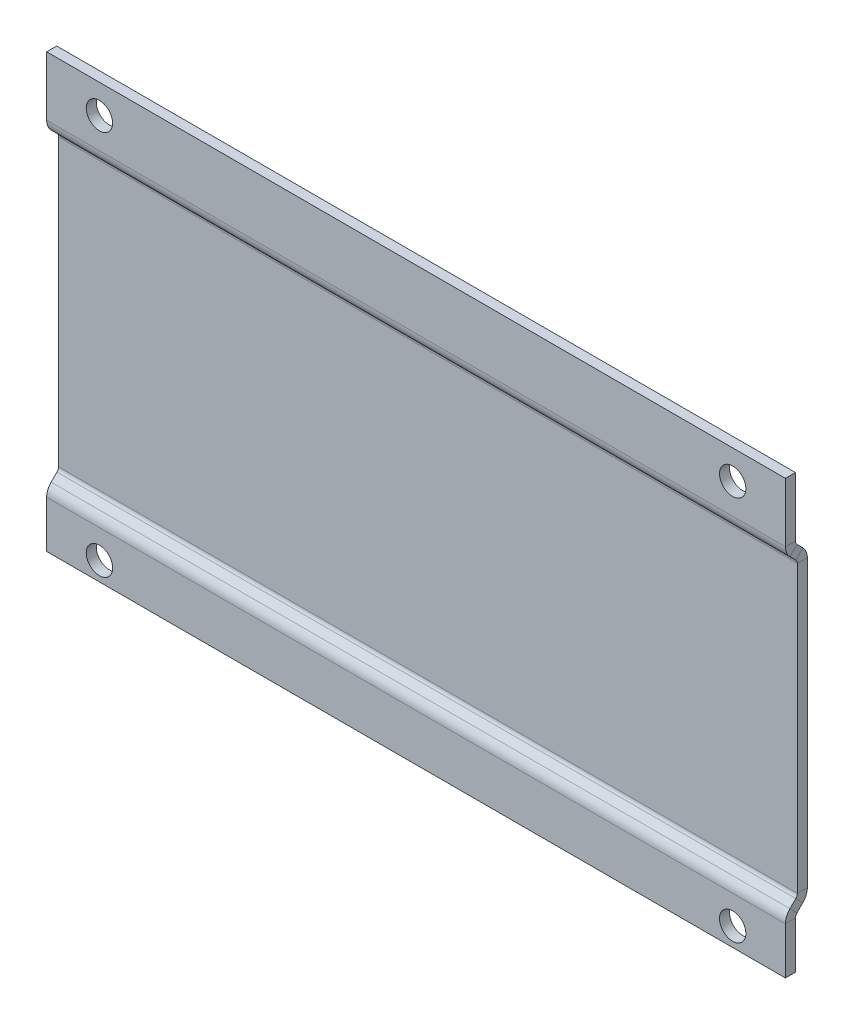
ISO-10303-21;
HEADER;
FILE_DESCRIPTION(('STEP AP214'),'2;1');
FILE_NAME('part.step','',(''),(''),'','','');
FILE_SCHEMA(('AUTOMOTIVE_DESIGN { 1 0 10303 214 1 1 1 1 }'));
ENDSEC;
DATA;
#1=APPLICATION_CONTEXT('core data for automotive mechanical design processes');
#2=APPLICATION_PROTOCOL_DEFINITION('international standard','automotive_design',2000,#1);
#3=PRODUCT_CONTEXT('',#1,'mechanical');
#4=PRODUCT('Part','Part','',(#3));
#5=PRODUCT_RELATED_PRODUCT_CATEGORY('part','',(#4));
#6=PRODUCT_DEFINITION_FORMATION('','',#4);
#7=PRODUCT_DEFINITION_CONTEXT('part definition',#1,'design');
#8=PRODUCT_DEFINITION('design','',#6,#7);
#9=PRODUCT_DEFINITION_SHAPE('','',#8);
#10=(LENGTH_UNIT() NAMED_UNIT(*) SI_UNIT(.MILLI.,.METRE.));
#11=(NAMED_UNIT(*) PLANE_ANGLE_UNIT() SI_UNIT($,.RADIAN.));
#12=(NAMED_UNIT(*) SI_UNIT($,.STERADIAN.) SOLID_ANGLE_UNIT());
#13=UNCERTAINTY_MEASURE_WITH_UNIT(LENGTH_MEASURE(1.E-05),#10,'distance_accuracy_value','');
#14=(GEOMETRIC_REPRESENTATION_CONTEXT(3) GLOBAL_UNCERTAINTY_ASSIGNED_CONTEXT((#13)) GLOBAL_UNIT_ASSIGNED_CONTEXT((#10,
#11,#12)) REPRESENTATION_CONTEXT('',''));
#15=CARTESIAN_POINT('',(0.,0.,0.));
#16=DIRECTION('',(0.,0.,1.));
#17=DIRECTION('',(1.,0.,0.));
#18=AXIS2_PLACEMENT_3D('',#15,#16,#17);
#19=CARTESIAN_POINT('',(0.,0.76416756607936,-2.25000000000001));
#20=DIRECTION('',(0.,0.,-1.));
#21=DIRECTION('',(-1.,0.,0.));
#22=AXIS2_PLACEMENT_3D('',#19,#20,#21);
#23=PLANE('',#22);
#24=DIRECTION('',(0.,-1.,0.));
#25=VECTOR('',#24,1.);
#26=CARTESIAN_POINT('',(0.,0.76416756607936,-2.25000000000001));
#27=LINE('',#26,#25);
#28=CARTESIAN_POINT('',(0.,66.9003303160574,-2.25000000000001));
#29=VERTEX_POINT('',#28);
#30=CARTESIAN_POINT('',(0.,12.7657632093125,-2.25000000000001));
#31=VERTEX_POINT('',#30);
#32=EDGE_CURVE('E355',#29,#31,#27,.T.);
#33=ORIENTED_EDGE('',*,*,#32,.T.);
#34=DIRECTION('',(1.,0.,0.));
#35=VECTOR('',#34,1.);
#36=CARTESIAN_POINT('',(0.,12.7657632093125,-2.25000000000001));
#37=LINE('',#36,#35);
#38=CARTESIAN_POINT('',(140.,12.7657632093125,-2.25000000000001));
#39=VERTEX_POINT('',#38);
#40=EDGE_CURVE('E366',#31,#39,#37,.T.);
#41=ORIENTED_EDGE('',*,*,#40,.T.);
#42=DIRECTION('',(0.,1.,0.));
#43=VECTOR('',#42,1.);
#44=CARTESIAN_POINT('',(140.,0.76416756607936,-2.25000000000001));
#45=LINE('',#44,#43);
#46=CARTESIAN_POINT('',(140.,66.9003303160574,-2.25000000000001));
#47=VERTEX_POINT('',#46);
#48=EDGE_CURVE('E359',#39,#47,#45,.T.);
#49=ORIENTED_EDGE('',*,*,#48,.T.);
#50=DIRECTION('',(1.,0.,0.));
#51=VECTOR('',#50,1.);
#52=CARTESIAN_POINT('',(0.,66.9003303160574,-2.25000000000001));
#53=LINE('',#52,#51);
#54=EDGE_CURVE('E345',#29,#47,#53,.T.);
#55=ORIENTED_EDGE('',*,*,#54,.F.);
#56=EDGE_LOOP('',(#33,#41,#49,#55));
#57=FACE_BOUND('',#56,.T.);
#58=ADVANCED_FACE('F49',(#57),#23,.F.);
#59=CARTESIAN_POINT('',(0.,19.7591552189013,-49.8053886595294));
#60=DIRECTION('',(0.,0.707106781186549,-0.707106781186546));
#61=DIRECTION('',(-1.,0.,0.));
#62=AXIS2_PLACEMENT_3D('',#59,#60,#61);
#63=PLANE('',#62);
#64=DIRECTION('',(0.,-0.707106781186546,-0.707106781186549));
#65=VECTOR('',#64,1.);
#66=CARTESIAN_POINT('',(0.,19.7591552189013,-49.8053886595294));
#67=LINE('',#66,#65);
#68=CARTESIAN_POINT('',(1.11022302462516E-13,68.7151535438715,-0.849390334559009));
#69=VERTEX_POINT('',#68);
#70=CARTESIAN_POINT('',(0.,67.607437097244,-1.95710678118655));
#71=VERTEX_POINT('',#70);
#72=EDGE_CURVE('E253',#69,#71,#67,.T.);
#73=ORIENTED_EDGE('',*,*,#72,.T.);
#74=DIRECTION('',(1.,0.,0.));
#75=VECTOR('',#74,1.);
#76=CARTESIAN_POINT('',(0.,67.607437097244,-1.95710678118655));
#77=LINE('',#76,#75);
#78=CARTESIAN_POINT('',(140.,67.607437097244,-1.95710678118655));
#79=VERTEX_POINT('',#78);
#80=EDGE_CURVE('E265',#71,#79,#77,.T.);
#81=ORIENTED_EDGE('',*,*,#80,.T.);
#82=DIRECTION('',(0.,0.707106781186546,0.707106781186549));
#83=VECTOR('',#82,1.);
#84=CARTESIAN_POINT('',(140.,19.7591552189013,-49.8053886595294));
#85=LINE('',#84,#83);
#86=CARTESIAN_POINT('',(140.,68.7151535438715,-0.849390334559009));
#87=VERTEX_POINT('',#86);
#88=EDGE_CURVE('E266',#79,#87,#85,.T.);
#89=ORIENTED_EDGE('',*,*,#88,.T.);
#90=DIRECTION('',(1.,0.,0.));
#91=VECTOR('',#90,1.);
#92=CARTESIAN_POINT('',(0.,68.7151535438715,-0.849390334559018));
#93=LINE('',#92,#91);
#94=EDGE_CURVE('E289',#69,#87,#93,.T.);
#95=ORIENTED_EDGE('',*,*,#94,.F.);
#96=EDGE_LOOP('',(#73,#81,#89,#95));
#97=FACE_BOUND('',#96,.T.);
#98=ADVANCED_FACE('F499',(#97),#63,.F.);
#99=CARTESIAN_POINT('',(0.,21.1026581031558,-51.1488915437838));
#100=DIRECTION('',(0.,0.707106781186549,-0.707106781186546));
#101=DIRECTION('',(-1.,0.,0.));
#102=AXIS2_PLACEMENT_3D('',#99,#100,#101);
#103=PLANE('',#102);
#104=DIRECTION('',(1.,0.,0.));
#105=VECTOR('',#104,1.);
#106=CARTESIAN_POINT('',(0.,68.9509399814984,-3.30060966544099));
#107=LINE('',#106,#105);
#108=CARTESIAN_POINT('',(0.,68.9509399814984,-3.30060966544099));
#109=VERTEX_POINT('',#108);
#110=CARTESIAN_POINT('',(140.,68.9509399814984,-3.30060966544099));
#111=VERTEX_POINT('',#110);
#112=EDGE_CURVE('E283',#109,#111,#107,.T.);
#113=ORIENTED_EDGE('',*,*,#112,.F.);
#114=DIRECTION('',(0.,-0.707106781186546,-0.707106781186549));
#115=VECTOR('',#114,1.);
#116=CARTESIAN_POINT('',(0.,21.1026581031558,-51.1488915437838));
#117=LINE('',#116,#115);
#118=CARTESIAN_POINT('',(0.,70.058656428126,-2.19289321881345));
#119=VERTEX_POINT('',#118);
#120=EDGE_CURVE('E269',#119,#109,#117,.T.);
#121=ORIENTED_EDGE('',*,*,#120,.F.);
#122=DIRECTION('',(1.,0.,0.));
#123=VECTOR('',#122,1.);
#124=CARTESIAN_POINT('',(0.,70.058656428126,-2.19289321881345));
#125=LINE('',#124,#123);
#126=CARTESIAN_POINT('',(140.,70.058656428126,-2.19289321881345));
#127=VERTEX_POINT('',#126);
#128=EDGE_CURVE('E263',#119,#127,#125,.T.);
#129=ORIENTED_EDGE('',*,*,#128,.T.);
#130=DIRECTION('',(0.,0.707106781186546,0.707106781186549));
#131=VECTOR('',#130,1.);
#132=CARTESIAN_POINT('',(140.,21.1026581031558,-51.1488915437838));
#133=LINE('',#132,#131);
#134=EDGE_CURVE('E259',#111,#127,#133,.T.);
#135=ORIENTED_EDGE('',*,*,#134,.F.);
#136=EDGE_LOOP('',(#113,#121,#129,#135));
#137=FACE_BOUND('',#136,.T.);
#138=ADVANCED_FACE('F490',(#137),#103,.T.);
#139=CARTESIAN_POINT('',(140.,21.1026581031558,-51.1488915437838));
#140=DIRECTION('',(1.,0.,0.));
#141=DIRECTION('',(0.,0.707106781186549,-0.707106781186546));
#142=AXIS2_PLACEMENT_3D('',#139,#140,#141);
#143=PLANE('',#142);
#144=DIRECTION('',(0.,-0.707106781186549,0.707106781186546));
#145=VECTOR('',#144,1.);
#146=CARTESIAN_POINT('',(140.,68.9509399814984,-3.30060966544099));
#147=LINE('',#146,#145);
#148=EDGE_CURVE('E280',#111,#79,#147,.T.);
#149=ORIENTED_EDGE('',*,*,#148,.F.);
#150=ORIENTED_EDGE('',*,*,#134,.T.);
#151=DIRECTION('',(0.,-0.707106781186549,0.707106781186546));
#152=VECTOR('',#151,1.);
#153=CARTESIAN_POINT('',(140.,70.058656428126,-2.19289321881345));
#154=LINE('',#153,#152);
#155=EDGE_CURVE('E262',#127,#87,#154,.T.);
#156=ORIENTED_EDGE('',*,*,#155,.T.);
#157=ORIENTED_EDGE('',*,*,#88,.F.);
#158=EDGE_LOOP('',(#149,#150,#156,#157));
#159=FACE_BOUND('',#158,.T.);
#160=ADVANCED_FACE('F483',(#159),#143,.T.);
#161=CARTESIAN_POINT('',(0.,21.1026581031558,-51.1488915437838));
#162=DIRECTION('',(-1.,0.,0.));
#163=DIRECTION('',(0.,-0.707106781186549,0.707106781186546));
#164=AXIS2_PLACEMENT_3D('',#161,#162,#163);
#165=PLANE('',#164);
#166=DIRECTION('',(0.,0.707106781186549,-0.707106781186546));
#167=VECTOR('',#166,1.);
#168=CARTESIAN_POINT('',(0.,68.9509399814984,-3.30060966544099));
#169=LINE('',#168,#167);
#170=EDGE_CURVE('E273',#71,#109,#169,.T.);
#171=ORIENTED_EDGE('',*,*,#170,.F.);
#172=ORIENTED_EDGE('',*,*,#72,.F.);
#173=DIRECTION('',(0.,0.707106781186549,-0.707106781186546));
#174=VECTOR('',#173,1.);
#175=CARTESIAN_POINT('',(0.,70.058656428126,-2.19289321881345));
#176=LINE('',#175,#174);
#177=EDGE_CURVE('E272',#69,#119,#176,.T.);
#178=ORIENTED_EDGE('',*,*,#177,.T.);
#179=ORIENTED_EDGE('',*,*,#120,.T.);
#180=EDGE_LOOP('',(#171,#172,#178,#179));
#181=FACE_BOUND('',#180,.T.);
#182=ADVANCED_FACE('F496',(#181),#165,.T.);
#183=CARTESIAN_POINT('',(0.,82.,-1.9));
#184=DIRECTION('',(0.,1.,0.));
#185=DIRECTION('',(0.,0.,1.));
#186=AXIS2_PLACEMENT_3D('',#183,#184,#185);
#187=PLANE('',#186);
#188=DIRECTION('',(-1.,0.,0.));
#189=VECTOR('',#188,1.);
#190=CARTESIAN_POINT('',(0.,82.,0.));
#191=LINE('',#190,#189);
#192=CARTESIAN_POINT('',(140.,82.,0.));
#193=VERTEX_POINT('',#192);
#194=CARTESIAN_POINT('',(0.,82.,0.));
#195=VERTEX_POINT('',#194);
#196=EDGE_CURVE('E321',#193,#195,#191,.T.);
#197=ORIENTED_EDGE('',*,*,#196,.F.);
#198=DIRECTION('',(0.,0.,1.));
#199=VECTOR('',#198,1.);
#200=CARTESIAN_POINT('',(140.,82.,-1.9));
#201=LINE('',#200,#199);
#202=CARTESIAN_POINT('',(140.,82.,-1.9));
#203=VERTEX_POINT('',#202);
#204=EDGE_CURVE('E326',#203,#193,#201,.T.);
#205=ORIENTED_EDGE('',*,*,#204,.F.);
#206=DIRECTION('',(-1.,0.,0.));
#207=VECTOR('',#206,1.);
#208=CARTESIAN_POINT('',(0.,82.,-1.9));
#209=LINE('',#208,#207);
#210=CARTESIAN_POINT('',(0.,82.,-1.9));
#211=VERTEX_POINT('',#210);
#212=EDGE_CURVE('E271',#203,#211,#209,.T.);
#213=ORIENTED_EDGE('',*,*,#212,.T.);
#214=DIRECTION('',(0.,0.,1.));
#215=VECTOR('',#214,1.);
#216=CARTESIAN_POINT('',(0.,82.,-1.9));
#217=LINE('',#216,#215);
#218=EDGE_CURVE('E310',#211,#195,#217,.T.);
#219=ORIENTED_EDGE('',*,*,#218,.T.);
#220=EDGE_LOOP('',(#197,#205,#213,#219));
#221=FACE_BOUND('',#220,.T.);
#222=ADVANCED_FACE('F531',(#221),#187,.T.);
#223=CARTESIAN_POINT('',(0.,0.,-1.9));
#224=DIRECTION('',(0.,0.,-1.));
#225=DIRECTION('',(-1.,0.,0.));
#226=AXIS2_PLACEMENT_3D('',#223,#224,#225);
#227=PLANE('',#226);
#228=CARTESIAN_POINT('',(10.0000000000016,76.5252573512631,-1.9));
#229=DIRECTION('',(0.,0.,-1.));
#230=DIRECTION('',(-1.,0.,0.));
#231=AXIS2_PLACEMENT_3D('',#228,#229,#230);
#232=CIRCLE('',#231,2.5);
#233=CARTESIAN_POINT('',(7.50000000000156,76.5252573512631,-1.9));
#234=VERTEX_POINT('',#233);
#235=EDGE_CURVE('E395',#234,#234,#232,.T.);
#236=ORIENTED_EDGE('',*,*,#235,.F.);
#237=EDGE_LOOP('',(#236));
#238=FACE_BOUND('',#237,.T.);
#239=CARTESIAN_POINT('',(130.000000000002,76.5252573512631,-1.9));
#240=DIRECTION('',(0.,0.,-1.));
#241=DIRECTION('',(-1.,0.,0.));
#242=AXIS2_PLACEMENT_3D('',#239,#240,#241);
#243=CIRCLE('',#242,2.5);
#244=CARTESIAN_POINT('',(127.500000000002,76.5252573512631,-1.9));
#245=VERTEX_POINT('',#244);
#246=EDGE_CURVE('E389',#245,#245,#243,.T.);
#247=ORIENTED_EDGE('',*,*,#246,.F.);
#248=EDGE_LOOP('',(#247));
#249=FACE_BOUND('',#248,.T.);
#250=DIRECTION('',(1.,0.,0.));
#251=VECTOR('',#250,1.);
#252=CARTESIAN_POINT('',(0.,70.7657632093125,-1.9));
#253=LINE('',#252,#251);
#254=CARTESIAN_POINT('',(0.,70.7657632093125,-1.9));
#255=VERTEX_POINT('',#254);
#256=CARTESIAN_POINT('',(140.,70.7657632093125,-1.9));
#257=VERTEX_POINT('',#256);
#258=EDGE_CURVE('E296',#255,#257,#253,.T.);
#259=ORIENTED_EDGE('',*,*,#258,.F.);
#260=DIRECTION('',(0.,-1.,0.));
#261=VECTOR('',#260,1.);
#262=CARTESIAN_POINT('',(0.,0.,-1.9));
#263=LINE('',#262,#261);
#264=EDGE_CURVE('E312',#211,#255,#263,.T.);
#265=ORIENTED_EDGE('',*,*,#264,.F.);
#266=ORIENTED_EDGE('',*,*,#212,.F.);
#267=DIRECTION('',(0.,1.,0.));
#268=VECTOR('',#267,1.);
#269=CARTESIAN_POINT('',(140.,0.,-1.9));
#270=LINE('',#269,#268);
#271=EDGE_CURVE('E324',#257,#203,#270,.T.);
#272=ORIENTED_EDGE('',*,*,#271,.F.);
#273=EDGE_LOOP('',(#259,#265,#266,#272));
#274=FACE_BOUND('',#273,.T.);
#275=ADVANCED_FACE('F519',(#238,#249,#274),#227,.T.);
#276=CARTESIAN_POINT('',(0.,0.,-1.9));
#277=DIRECTION('',(-1.,0.,0.));
#278=DIRECTION('',(0.,0.,1.));
#279=AXIS2_PLACEMENT_3D('',#276,#277,#278);
#280=PLANE('',#279);
#281=DIRECTION('',(0.,0.,-1.));
#282=VECTOR('',#281,1.);
#283=CARTESIAN_POINT('',(0.,70.7657632093125,-1.9));
#284=LINE('',#283,#282);
#285=CARTESIAN_POINT('',(0.,70.7657632093125,0.));
#286=VERTEX_POINT('',#285);
#287=EDGE_CURVE('E304',#286,#255,#284,.T.);
#288=ORIENTED_EDGE('',*,*,#287,.F.);
#289=DIRECTION('',(0.,-1.,0.));
#290=VECTOR('',#289,1.);
#291=CARTESIAN_POINT('',(0.,0.,0.));
#292=LINE('',#291,#290);
#293=EDGE_CURVE('E314',#195,#286,#292,.T.);
#294=ORIENTED_EDGE('',*,*,#293,.F.);
#295=ORIENTED_EDGE('',*,*,#218,.F.);
#296=ORIENTED_EDGE('',*,*,#264,.T.);
#297=EDGE_LOOP('',(#288,#294,#295,#296));
#298=FACE_BOUND('',#297,.T.);
#299=ADVANCED_FACE('F526',(#298),#280,.T.);
#300=CARTESIAN_POINT('',(0.,0.,0.));
#301=DIRECTION('',(0.,0.,-1.));
#302=DIRECTION('',(-1.,0.,0.));
#303=AXIS2_PLACEMENT_3D('',#300,#301,#302);
#304=PLANE('',#303);
#305=CARTESIAN_POINT('',(10.0000000000016,76.5252573512631,0.));
#306=DIRECTION('',(0.,0.,-1.));
#307=DIRECTION('',(-1.,0.,0.));
#308=AXIS2_PLACEMENT_3D('',#305,#306,#307);
#309=CIRCLE('',#308,2.5);
#310=CARTESIAN_POINT('',(7.50000000000156,76.5252573512631,0.));
#311=VERTEX_POINT('',#310);
#312=EDGE_CURVE('E393',#311,#311,#309,.T.);
#313=ORIENTED_EDGE('',*,*,#312,.T.);
#314=EDGE_LOOP('',(#313));
#315=FACE_BOUND('',#314,.T.);
#316=CARTESIAN_POINT('',(130.000000000002,76.5252573512631,0.));
#317=DIRECTION('',(0.,0.,-1.));
#318=DIRECTION('',(-1.,0.,0.));
#319=AXIS2_PLACEMENT_3D('',#316,#317,#318);
#320=CIRCLE('',#319,2.5);
#321=CARTESIAN_POINT('',(127.500000000002,76.5252573512631,0.));
#322=VERTEX_POINT('',#321);
#323=EDGE_CURVE('E219',#322,#322,#320,.T.);
#324=ORIENTED_EDGE('',*,*,#323,.T.);
#325=EDGE_LOOP('',(#324));
#326=FACE_BOUND('',#325,.T.);
#327=ORIENTED_EDGE('',*,*,#293,.T.);
#328=DIRECTION('',(1.,0.,0.));
#329=VECTOR('',#328,1.);
#330=CARTESIAN_POINT('',(0.,70.7657632093125,0.));
#331=LINE('',#330,#329);
#332=CARTESIAN_POINT('',(140.,70.7657632093125,0.));
#333=VERTEX_POINT('',#332);
#334=EDGE_CURVE('E316',#286,#333,#331,.T.);
#335=ORIENTED_EDGE('',*,*,#334,.T.);
#336=DIRECTION('',(0.,1.,0.));
#337=VECTOR('',#336,1.);
#338=CARTESIAN_POINT('',(140.,0.,0.));
#339=LINE('',#338,#337);
#340=EDGE_CURVE('E319',#333,#193,#339,.T.);
#341=ORIENTED_EDGE('',*,*,#340,.T.);
#342=ORIENTED_EDGE('',*,*,#196,.T.);
#343=EDGE_LOOP('',(#327,#335,#341,#342));
#344=FACE_BOUND('',#343,.T.);
#345=ADVANCED_FACE('F528',(#315,#326,#344),#304,.F.);
#346=CARTESIAN_POINT('',(140.,0.,-1.9));
#347=DIRECTION('',(1.,0.,0.));
#348=DIRECTION('',(0.,0.,-1.));
#349=AXIS2_PLACEMENT_3D('',#346,#347,#348);
#350=PLANE('',#349);
#351=DIRECTION('',(0.,0.,1.));
#352=VECTOR('',#351,1.);
#353=CARTESIAN_POINT('',(140.,70.7657632093125,-1.9));
#354=LINE('',#353,#352);
#355=EDGE_CURVE('E300',#257,#333,#354,.T.);
#356=ORIENTED_EDGE('',*,*,#355,.F.);
#357=ORIENTED_EDGE('',*,*,#271,.T.);
#358=ORIENTED_EDGE('',*,*,#204,.T.);
#359=ORIENTED_EDGE('',*,*,#340,.F.);
#360=EDGE_LOOP('',(#356,#357,#358,#359));
#361=FACE_BOUND('',#360,.T.);
#362=ADVANCED_FACE('F511',(#361),#350,.T.);
#363=CARTESIAN_POINT('',(0.,70.7657632093125,-2.9));
#364=DIRECTION('',(1.,0.,0.));
#365=DIRECTION('',(0.,1.,0.));
#366=AXIS2_PLACEMENT_3D('',#363,#364,#365);
#367=PLANE('',#366);
#368=ORIENTED_EDGE('',*,*,#177,.F.);
#369=CARTESIAN_POINT('',(1.11022302462516E-13,70.7657632093125,-2.9));
#370=DIRECTION('',(-1.,0.,0.));
#371=DIRECTION('',(0.,0.,1.));
#372=AXIS2_PLACEMENT_3D('',#369,#370,#371);
#373=CIRCLE('',#372,2.9);
#374=EDGE_CURVE('E307',#69,#286,#373,.T.);
#375=ORIENTED_EDGE('',*,*,#374,.T.);
#376=ORIENTED_EDGE('',*,*,#287,.T.);
#377=CARTESIAN_POINT('',(0.,70.7657632093125,-2.9));
#378=DIRECTION('',(-1.,0.,0.));
#379=DIRECTION('',(0.,1.,0.));
#380=AXIS2_PLACEMENT_3D('',#377,#378,#379);
#381=CIRCLE('',#380,0.999999999999999);
#382=EDGE_CURVE('E291',#119,#255,#381,.T.);
#383=ORIENTED_EDGE('',*,*,#382,.F.);
#384=EDGE_LOOP('',(#368,#375,#376,#383));
#385=FACE_BOUND('',#384,.T.);
#386=ADVANCED_FACE('F523',(#385),#367,.F.);
#387=CARTESIAN_POINT('',(140.,70.7657632093125,-2.9));
#388=DIRECTION('',(-1.,0.,0.));
#389=DIRECTION('',(0.,0.,1.));
#390=AXIS2_PLACEMENT_3D('',#387,#388,#389);
#391=PLANE('',#390);
#392=CARTESIAN_POINT('',(140.,70.7657632093125,-2.9));
#393=DIRECTION('',(-1.,0.,0.));
#394=DIRECTION('',(0.,0.,1.));
#395=AXIS2_PLACEMENT_3D('',#392,#393,#394);
#396=CIRCLE('',#395,2.9);
#397=EDGE_CURVE('E303',#333,#87,#396,.F.);
#398=ORIENTED_EDGE('',*,*,#397,.T.);
#399=ORIENTED_EDGE('',*,*,#155,.F.);
#400=CARTESIAN_POINT('',(140.,70.7657632093125,-2.9));
#401=DIRECTION('',(1.,0.,0.));
#402=DIRECTION('',(0.,0.,1.));
#403=AXIS2_PLACEMENT_3D('',#400,#401,#402);
#404=CIRCLE('',#403,0.999999999999999);
#405=EDGE_CURVE('E299',#257,#127,#404,.T.);
#406=ORIENTED_EDGE('',*,*,#405,.F.);
#407=ORIENTED_EDGE('',*,*,#355,.T.);
#408=EDGE_LOOP('',(#398,#399,#406,#407));
#409=FACE_BOUND('',#408,.T.);
#410=ADVANCED_FACE('F507',(#409),#391,.F.);
#411=CARTESIAN_POINT('',(210.021268288682,70.7657632093125,-2.9));
#412=DIRECTION('',(-1.,0.,0.));
#413=DIRECTION('',(0.,0.,1.));
#414=AXIS2_PLACEMENT_3D('',#411,#412,#413);
#415=CYLINDRICAL_SURFACE('',#414,1.);
#416=ORIENTED_EDGE('',*,*,#258,.T.);
#417=ORIENTED_EDGE('',*,*,#405,.T.);
#418=ORIENTED_EDGE('',*,*,#128,.F.);
#419=ORIENTED_EDGE('',*,*,#382,.T.);
#420=EDGE_LOOP('',(#416,#417,#418,#419));
#421=FACE_BOUND('',#420,.T.);
#422=ADVANCED_FACE('F515',(#421),#415,.F.);
#423=CARTESIAN_POINT('',(210.021268288682,70.7657632093125,-2.9));
#424=DIRECTION('',(-1.,0.,0.));
#425=DIRECTION('',(0.,0.,1.));
#426=AXIS2_PLACEMENT_3D('',#423,#424,#425);
#427=CYLINDRICAL_SURFACE('',#426,2.9);
#428=ORIENTED_EDGE('',*,*,#334,.F.);
#429=ORIENTED_EDGE('',*,*,#374,.F.);
#430=ORIENTED_EDGE('',*,*,#94,.T.);
#431=ORIENTED_EDGE('',*,*,#397,.F.);
#432=EDGE_LOOP('',(#428,#429,#430,#431));
#433=FACE_BOUND('',#432,.T.);
#434=ADVANCED_FACE('F504',(#433),#427,.T.);
#435=CARTESIAN_POINT('',(0.,66.9003303160574,-1.25000000000001));
#436=DIRECTION('',(-1.,0.,0.));
#437=DIRECTION('',(0.,0.,1.));
#438=AXIS2_PLACEMENT_3D('',#435,#436,#437);
#439=PLANE('',#438);
#440=DIRECTION('',(0.,0.,-1.));
#441=VECTOR('',#440,1.);
#442=CARTESIAN_POINT('',(0.,66.9003303160574,-4.15000000000001));
#443=LINE('',#442,#441);
#444=CARTESIAN_POINT('',(0.,66.9003303160574,-4.15000000000001));
#445=VERTEX_POINT('',#444);
#446=EDGE_CURVE('E356',#29,#445,#443,.T.);
#447=ORIENTED_EDGE('',*,*,#446,.F.);
#448=CARTESIAN_POINT('',(0.,66.9003303160574,-1.25000000000001));
#449=DIRECTION('',(-1.,0.,0.));
#450=DIRECTION('',(0.,0.,1.));
#451=AXIS2_PLACEMENT_3D('',#448,#449,#450);
#452=CIRCLE('',#451,1.);
#453=EDGE_CURVE('E277',#29,#71,#452,.F.);
#454=ORIENTED_EDGE('',*,*,#453,.T.);
#455=ORIENTED_EDGE('',*,*,#170,.T.);
#456=CARTESIAN_POINT('',(0.,66.9003303160574,-1.25000000000001));
#457=DIRECTION('',(1.,0.,0.));
#458=DIRECTION('',(0.,0.,1.));
#459=AXIS2_PLACEMENT_3D('',#456,#457,#458);
#460=CIRCLE('',#459,2.9);
#461=EDGE_CURVE('E342',#445,#109,#460,.T.);
#462=ORIENTED_EDGE('',*,*,#461,.F.);
#463=EDGE_LOOP('',(#447,#454,#455,#462));
#464=FACE_BOUND('',#463,.T.);
#465=ADVANCED_FACE('F493',(#464),#439,.T.);
#466=CARTESIAN_POINT('',(140.,66.9003303160574,-1.25000000000001));
#467=DIRECTION('',(1.,0.,0.));
#468=DIRECTION('',(0.,0.,-1.));
#469=AXIS2_PLACEMENT_3D('',#466,#467,#468);
#470=PLANE('',#469);
#471=CARTESIAN_POINT('',(140.,66.9003303160574,-1.25000000000001));
#472=DIRECTION('',(-1.,0.,0.));
#473=DIRECTION('',(0.,0.,1.));
#474=AXIS2_PLACEMENT_3D('',#471,#472,#473);
#475=CIRCLE('',#474,1.);
#476=EDGE_CURVE('E276',#79,#47,#475,.T.);
#477=ORIENTED_EDGE('',*,*,#476,.T.);
#478=DIRECTION('',(0.,0.,1.));
#479=VECTOR('',#478,1.);
#480=CARTESIAN_POINT('',(140.,66.9003303160574,-4.15000000000001));
#481=LINE('',#480,#479);
#482=CARTESIAN_POINT('',(140.,66.9003303160574,-4.15000000000001));
#483=VERTEX_POINT('',#482);
#484=EDGE_CURVE('E352',#483,#47,#481,.T.);
#485=ORIENTED_EDGE('',*,*,#484,.F.);
#486=CARTESIAN_POINT('',(140.,66.9003303160574,-1.25000000000001));
#487=DIRECTION('',(-1.,0.,0.));
#488=DIRECTION('',(0.,0.,-1.));
#489=AXIS2_PLACEMENT_3D('',#486,#487,#488);
#490=CIRCLE('',#489,2.9);
#491=EDGE_CURVE('E286',#111,#483,#490,.T.);
#492=ORIENTED_EDGE('',*,*,#491,.F.);
#493=ORIENTED_EDGE('',*,*,#148,.T.);
#494=EDGE_LOOP('',(#477,#485,#492,#493));
#495=FACE_BOUND('',#494,.T.);
#496=ADVANCED_FACE('F480',(#495),#470,.T.);
#497=CARTESIAN_POINT('',(210.042048590992,66.9003303160574,-1.25000000000001));
#498=DIRECTION('',(-1.,0.,0.));
#499=DIRECTION('',(0.,0.,1.));
#500=AXIS2_PLACEMENT_3D('',#497,#498,#499);
#501=CYLINDRICAL_SURFACE('',#500,2.9);
#502=ORIENTED_EDGE('',*,*,#112,.T.);
#503=ORIENTED_EDGE('',*,*,#491,.T.);
#504=DIRECTION('',(1.,0.,0.));
#505=VECTOR('',#504,1.);
#506=CARTESIAN_POINT('',(0.,66.9003303160574,-4.15000000000001));
#507=LINE('',#506,#505);
#508=EDGE_CURVE('E348',#445,#483,#507,.T.);
#509=ORIENTED_EDGE('',*,*,#508,.F.);
#510=ORIENTED_EDGE('',*,*,#461,.T.);
#511=EDGE_LOOP('',(#502,#503,#509,#510));
#512=FACE_BOUND('',#511,.T.);
#513=ADVANCED_FACE('F486',(#512),#501,.T.);
#514=CARTESIAN_POINT('',(210.042048590992,66.9003303160574,-1.25000000000001));
#515=DIRECTION('',(-1.,0.,0.));
#516=DIRECTION('',(0.,0.,1.));
#517=AXIS2_PLACEMENT_3D('',#514,#515,#516);
#518=CYLINDRICAL_SURFACE('',#517,1.);
#519=ORIENTED_EDGE('',*,*,#80,.F.);
#520=ORIENTED_EDGE('',*,*,#453,.F.);
#521=ORIENTED_EDGE('',*,*,#54,.T.);
#522=ORIENTED_EDGE('',*,*,#476,.F.);
#523=EDGE_LOOP('',(#519,#520,#521,#522));
#524=FACE_BOUND('',#523,.T.);
#525=ADVANCED_FACE('F478',(#524),#518,.F.);
#526=CARTESIAN_POINT('',(0.,0.76416756607936,-4.15000000000001));
#527=DIRECTION('',(0.,0.,-1.));
#528=DIRECTION('',(-1.,0.,0.));
#529=AXIS2_PLACEMENT_3D('',#526,#527,#528);
#530=PLANE('',#529);
#531=DIRECTION('',(1.,0.,0.));
#532=VECTOR('',#531,1.);
#533=CARTESIAN_POINT('',(0.,12.7657632093125,-4.15000000000001));
#534=LINE('',#533,#532);
#535=CARTESIAN_POINT('',(0.,12.7657632093125,-4.15000000000001));
#536=VERTEX_POINT('',#535);
#537=CARTESIAN_POINT('',(140.,12.7657632093125,-4.15000000000001));
#538=VERTEX_POINT('',#537);
#539=EDGE_CURVE('E360',#536,#538,#534,.T.);
#540=ORIENTED_EDGE('',*,*,#539,.F.);
#541=DIRECTION('',(0.,-1.,0.));
#542=VECTOR('',#541,1.);
#543=CARTESIAN_POINT('',(0.,0.76416756607936,-4.15000000000001));
#544=LINE('',#543,#542);
#545=EDGE_CURVE('E358',#445,#536,#544,.T.);
#546=ORIENTED_EDGE('',*,*,#545,.F.);
#547=ORIENTED_EDGE('',*,*,#508,.T.);
#548=DIRECTION('',(0.,1.,0.));
#549=VECTOR('',#548,1.);
#550=CARTESIAN_POINT('',(140.,0.76416756607936,-4.15000000000001));
#551=LINE('',#550,#549);
#552=EDGE_CURVE('E351',#538,#483,#551,.T.);
#553=ORIENTED_EDGE('',*,*,#552,.F.);
#554=EDGE_LOOP('',(#540,#546,#547,#553));
#555=FACE_BOUND('',#554,.T.);
#556=ADVANCED_FACE('F454',(#555),#530,.T.);
#557=CARTESIAN_POINT('',(140.,0.76416756607936,-4.15000000000001));
#558=DIRECTION('',(1.,0.,0.));
#559=DIRECTION('',(0.,0.,-1.));
#560=AXIS2_PLACEMENT_3D('',#557,#558,#559);
#561=PLANE('',#560);
#562=DIRECTION('',(0.,0.,1.));
#563=VECTOR('',#562,1.);
#564=CARTESIAN_POINT('',(140.,12.7657632093125,-4.15000000000001));
#565=LINE('',#564,#563);
#566=EDGE_CURVE('E363',#538,#39,#565,.T.);
#567=ORIENTED_EDGE('',*,*,#566,.F.);
#568=ORIENTED_EDGE('',*,*,#552,.T.);
#569=ORIENTED_EDGE('',*,*,#484,.T.);
#570=ORIENTED_EDGE('',*,*,#48,.F.);
#571=EDGE_LOOP('',(#567,#568,#569,#570));
#572=FACE_BOUND('',#571,.T.);
#573=ADVANCED_FACE('F470',(#572),#561,.T.);
#574=CARTESIAN_POINT('',(0.,0.76416756607936,-4.15000000000001));
#575=DIRECTION('',(-1.,0.,0.));
#576=DIRECTION('',(0.,0.,1.));
#577=AXIS2_PLACEMENT_3D('',#574,#575,#576);
#578=PLANE('',#577);
#579=DIRECTION('',(0.,0.,-1.));
#580=VECTOR('',#579,1.);
#581=CARTESIAN_POINT('',(0.,12.7657632093125,-4.15000000000001));
#582=LINE('',#581,#580);
#583=EDGE_CURVE('E369',#31,#536,#582,.T.);
#584=ORIENTED_EDGE('',*,*,#583,.F.);
#585=ORIENTED_EDGE('',*,*,#32,.F.);
#586=ORIENTED_EDGE('',*,*,#446,.T.);
#587=ORIENTED_EDGE('',*,*,#545,.T.);
#588=EDGE_LOOP('',(#584,#585,#586,#587));
#589=FACE_BOUND('',#588,.T.);
#590=ADVANCED_FACE('F464',(#589),#578,.T.);
#591=CARTESIAN_POINT('',(0.,12.7657632093125,-1.25000000000001));
#592=DIRECTION('',(-1.,0.,0.));
#593=DIRECTION('',(0.,-1.,0.));
#594=AXIS2_PLACEMENT_3D('',#591,#592,#593);
#595=PLANE('',#594);
#596=DIRECTION('',(0.,-0.707106781186549,-0.707106781186546));
#597=VECTOR('',#596,1.);
#598=CARTESIAN_POINT('',(0.,10.7151535438715,-3.30060966544099));
#599=LINE('',#598,#597);
#600=CARTESIAN_POINT('',(0.,12.058656428126,-1.95710678118655));
#601=VERTEX_POINT('',#600);
#602=CARTESIAN_POINT('',(0.,10.7151535438715,-3.30060966544099));
#603=VERTEX_POINT('',#602);
#604=EDGE_CURVE('E235',#601,#603,#599,.T.);
#605=ORIENTED_EDGE('',*,*,#604,.F.);
#606=CARTESIAN_POINT('',(1.11022302462516E-13,12.7657632093125,-1.25000000000001));
#607=DIRECTION('',(-1.,0.,0.));
#608=DIRECTION('',(0.,-1.,0.));
#609=AXIS2_PLACEMENT_3D('',#606,#607,#608);
#610=CIRCLE('',#609,1.);
#611=EDGE_CURVE('E254',#601,#31,#610,.F.);
#612=ORIENTED_EDGE('',*,*,#611,.T.);
#613=ORIENTED_EDGE('',*,*,#583,.T.);
#614=CARTESIAN_POINT('',(0.,12.7657632093125,-1.25000000000001));
#615=DIRECTION('',(1.,0.,0.));
#616=DIRECTION('',(0.,-1.,0.));
#617=AXIS2_PLACEMENT_3D('',#614,#615,#616);
#618=CIRCLE('',#617,2.9);
#619=EDGE_CURVE('E246',#603,#536,#618,.T.);
#620=ORIENTED_EDGE('',*,*,#619,.F.);
#621=EDGE_LOOP('',(#605,#612,#613,#620));
#622=FACE_BOUND('',#621,.T.);
#623=ADVANCED_FACE('F460',(#622),#595,.T.);
#624=CARTESIAN_POINT('',(140.,12.7657632093125,-1.25000000000001));
#625=DIRECTION('',(1.,0.,0.));
#626=DIRECTION('',(0.,0.,-1.));
#627=AXIS2_PLACEMENT_3D('',#624,#625,#626);
#628=PLANE('',#627);
#629=CARTESIAN_POINT('',(140.,12.7657632093125,-1.25000000000001));
#630=DIRECTION('',(-1.,0.,0.));
#631=DIRECTION('',(0.,-1.,0.));
#632=AXIS2_PLACEMENT_3D('',#629,#630,#631);
#633=CIRCLE('',#632,1.);
#634=CARTESIAN_POINT('',(140.,12.058656428126,-1.95710678118655));
#635=VERTEX_POINT('',#634);
#636=EDGE_CURVE('E250',#39,#635,#633,.T.);
#637=ORIENTED_EDGE('',*,*,#636,.T.);
#638=DIRECTION('',(0.,0.707106781186549,0.707106781186546));
#639=VECTOR('',#638,1.);
#640=CARTESIAN_POINT('',(140.,10.7151535438715,-3.30060966544099));
#641=LINE('',#640,#639);
#642=CARTESIAN_POINT('',(140.,10.7151535438715,-3.30060966544099));
#643=VERTEX_POINT('',#642);
#644=EDGE_CURVE('E238',#643,#635,#641,.T.);
#645=ORIENTED_EDGE('',*,*,#644,.F.);
#646=CARTESIAN_POINT('',(140.,12.7657632093125,-1.25000000000001));
#647=DIRECTION('',(-1.,0.,0.));
#648=DIRECTION('',(0.,0.,-1.));
#649=AXIS2_PLACEMENT_3D('',#646,#647,#648);
#650=CIRCLE('',#649,2.9);
#651=EDGE_CURVE('E249',#538,#643,#650,.T.);
#652=ORIENTED_EDGE('',*,*,#651,.F.);
#653=ORIENTED_EDGE('',*,*,#566,.T.);
#654=EDGE_LOOP('',(#637,#645,#652,#653));
#655=FACE_BOUND('',#654,.T.);
#656=ADVANCED_FACE('F448',(#655),#628,.T.);
#657=CARTESIAN_POINT('',(210.021268288682,12.7657632093125,-1.25000000000001));
#658=DIRECTION('',(-1.,0.,0.));
#659=DIRECTION('',(0.,-1.,0.));
#660=AXIS2_PLACEMENT_3D('',#657,#658,#659);
#661=CYLINDRICAL_SURFACE('',#660,2.9);
#662=ORIENTED_EDGE('',*,*,#539,.T.);
#663=ORIENTED_EDGE('',*,*,#651,.T.);
#664=DIRECTION('',(1.,0.,0.));
#665=VECTOR('',#664,1.);
#666=CARTESIAN_POINT('',(0.,10.7151535438715,-3.30060966544099));
#667=LINE('',#666,#665);
#668=EDGE_CURVE('E241',#603,#643,#667,.T.);
#669=ORIENTED_EDGE('',*,*,#668,.F.);
#670=ORIENTED_EDGE('',*,*,#619,.T.);
#671=EDGE_LOOP('',(#662,#663,#669,#670));
#672=FACE_BOUND('',#671,.T.);
#673=ADVANCED_FACE('F450',(#672),#661,.T.);
#674=CARTESIAN_POINT('',(210.021268288682,12.7657632093125,-1.25000000000001));
#675=DIRECTION('',(-1.,0.,0.));
#676=DIRECTION('',(0.,-1.,0.));
#677=AXIS2_PLACEMENT_3D('',#674,#675,#676);
#678=CYLINDRICAL_SURFACE('',#677,1.);
#679=ORIENTED_EDGE('',*,*,#40,.F.);
#680=ORIENTED_EDGE('',*,*,#611,.F.);
#681=DIRECTION('',(1.,0.,0.));
#682=VECTOR('',#681,1.);
#683=CARTESIAN_POINT('',(0.,12.058656428126,-1.95710678118655));
#684=LINE('',#683,#682);
#685=EDGE_CURVE('E230',#601,#635,#684,.T.);
#686=ORIENTED_EDGE('',*,*,#685,.T.);
#687=ORIENTED_EDGE('',*,*,#636,.F.);
#688=EDGE_LOOP('',(#679,#680,#686,#687));
#689=FACE_BOUND('',#688,.T.);
#690=ADVANCED_FACE('F467',(#689),#678,.F.);
#691=CARTESIAN_POINT('',(0.,3.31169659565855,4.10284728277201));
#692=DIRECTION('',(0.,-0.707106781186549,-0.707106781186546));
#693=DIRECTION('',(-1.,0.,0.));
#694=AXIS2_PLACEMENT_3D('',#691,#692,#693);
#695=PLANE('',#694);
#696=DIRECTION('',(1.,0.,0.));
#697=VECTOR('',#696,1.);
#698=CARTESIAN_POINT('',(0.,9.607437097244,-2.19289321881345));
#699=LINE('',#698,#697);
#700=CARTESIAN_POINT('',(0.,9.607437097244,-2.19289321881345));
#701=VERTEX_POINT('',#700);
#702=CARTESIAN_POINT('',(140.,9.607437097244,-2.19289321881345));
#703=VERTEX_POINT('',#702);
#704=EDGE_CURVE('E372',#701,#703,#699,.T.);
#705=ORIENTED_EDGE('',*,*,#704,.F.);
#706=DIRECTION('',(0.,-0.707106781186546,0.707106781186549));
#707=VECTOR('',#706,1.);
#708=CARTESIAN_POINT('',(0.,3.31169659565855,4.10284728277201));
#709=LINE('',#708,#707);
#710=EDGE_CURVE('E237',#603,#701,#709,.T.);
#711=ORIENTED_EDGE('',*,*,#710,.F.);
#712=ORIENTED_EDGE('',*,*,#668,.T.);
#713=DIRECTION('',(0.,0.707106781186546,-0.707106781186549));
#714=VECTOR('',#713,1.);
#715=CARTESIAN_POINT('',(140.,3.31169659565855,4.10284728277202));
#716=LINE('',#715,#714);
#717=EDGE_CURVE('E240',#703,#643,#716,.T.);
#718=ORIENTED_EDGE('',*,*,#717,.F.);
#719=EDGE_LOOP('',(#705,#711,#712,#718));
#720=FACE_BOUND('',#719,.T.);
#721=ADVANCED_FACE('F432',(#720),#695,.T.);
#722=CARTESIAN_POINT('',(140.,3.31169659565855,4.10284728277202));
#723=DIRECTION('',(1.,0.,0.));
#724=DIRECTION('',(0.,-0.707106781186549,-0.707106781186546));
#725=AXIS2_PLACEMENT_3D('',#722,#723,#724);
#726=PLANE('',#725);
#727=DIRECTION('',(0.,0.707106781186549,0.707106781186546));
#728=VECTOR('',#727,1.);
#729=CARTESIAN_POINT('',(140.,9.607437097244,-2.19289321881345));
#730=LINE('',#729,#728);
#731=CARTESIAN_POINT('',(140.,10.9509399814984,-0.849390334559012));
#732=VERTEX_POINT('',#731);
#733=EDGE_CURVE('E379',#703,#732,#730,.T.);
#734=ORIENTED_EDGE('',*,*,#733,.F.);
#735=ORIENTED_EDGE('',*,*,#717,.T.);
#736=ORIENTED_EDGE('',*,*,#644,.T.);
#737=DIRECTION('',(0.,0.707106781186546,-0.707106781186549));
#738=VECTOR('',#737,1.);
#739=CARTESIAN_POINT('',(140.,4.655199479913,5.44635016702645));
#740=LINE('',#739,#738);
#741=EDGE_CURVE('E74',#732,#635,#740,.T.);
#742=ORIENTED_EDGE('',*,*,#741,.F.);
#743=EDGE_LOOP('',(#734,#735,#736,#742));
#744=FACE_BOUND('',#743,.T.);
#745=ADVANCED_FACE('F442',(#744),#726,.T.);
#746=CARTESIAN_POINT('',(0.,4.655199479913,5.44635016702645));
#747=DIRECTION('',(0.,-0.707106781186549,-0.707106781186546));
#748=DIRECTION('',(-1.,0.,0.));
#749=AXIS2_PLACEMENT_3D('',#746,#747,#748);
#750=PLANE('',#749);
#751=DIRECTION('',(0.,-0.707106781186546,0.707106781186549));
#752=VECTOR('',#751,1.);
#753=CARTESIAN_POINT('',(0.,4.655199479913,5.44635016702645));
#754=LINE('',#753,#752);
#755=CARTESIAN_POINT('',(0.,10.9509399814984,-0.849390334559015));
#756=VERTEX_POINT('',#755);
#757=EDGE_CURVE('E66',#601,#756,#754,.T.);
#758=ORIENTED_EDGE('',*,*,#757,.T.);
#759=DIRECTION('',(1.,0.,0.));
#760=VECTOR('',#759,1.);
#761=CARTESIAN_POINT('',(0.,10.9509399814984,-0.849390334559013));
#762=LINE('',#761,#760);
#763=EDGE_CURVE('E58',#756,#732,#762,.T.);
#764=ORIENTED_EDGE('',*,*,#763,.T.);
#765=ORIENTED_EDGE('',*,*,#741,.T.);
#766=ORIENTED_EDGE('',*,*,#685,.F.);
#767=EDGE_LOOP('',(#758,#764,#765,#766));
#768=FACE_BOUND('',#767,.T.);
#769=ADVANCED_FACE('F441',(#768),#750,.F.);
#770=CARTESIAN_POINT('',(0.,3.31169659565855,4.10284728277201));
#771=DIRECTION('',(-1.,0.,0.));
#772=DIRECTION('',(0.,0.707106781186549,0.707106781186546));
#773=AXIS2_PLACEMENT_3D('',#770,#771,#772);
#774=PLANE('',#773);
#775=DIRECTION('',(0.,-0.707106781186549,-0.707106781186546));
#776=VECTOR('',#775,1.);
#777=CARTESIAN_POINT('',(0.,9.607437097244,-2.19289321881345));
#778=LINE('',#777,#776);
#779=EDGE_CURVE('E12',#756,#701,#778,.T.);
#780=ORIENTED_EDGE('',*,*,#779,.F.);
#781=ORIENTED_EDGE('',*,*,#757,.F.);
#782=ORIENTED_EDGE('',*,*,#604,.T.);
#783=ORIENTED_EDGE('',*,*,#710,.T.);
#784=EDGE_LOOP('',(#780,#781,#782,#783));
#785=FACE_BOUND('',#784,.T.);
#786=ADVANCED_FACE('F51',(#785),#774,.T.);
#787=CARTESIAN_POINT('',(0.,8.90033031605745,-2.9));
#788=DIRECTION('',(1.,0.,0.));
#789=DIRECTION('',(0.,1.,0.));
#790=AXIS2_PLACEMENT_3D('',#787,#788,#789);
#791=PLANE('',#790);
#792=DIRECTION('',(0.,0.,-1.));
#793=VECTOR('',#792,1.);
#794=CARTESIAN_POINT('',(0.,8.90033031605745,-1.9));
#795=LINE('',#794,#793);
#796=CARTESIAN_POINT('',(0.,8.90033031605745,0.));
#797=VERTEX_POINT('',#796);
#798=CARTESIAN_POINT('',(0.,8.90033031605745,-1.9));
#799=VERTEX_POINT('',#798);
#800=EDGE_CURVE('E195',#797,#799,#795,.T.);
#801=ORIENTED_EDGE('',*,*,#800,.F.);
#802=CARTESIAN_POINT('',(0.,8.90033031605745,-2.9));
#803=DIRECTION('',(-1.,0.,0.));
#804=DIRECTION('',(0.,-1.,0.));
#805=AXIS2_PLACEMENT_3D('',#802,#803,#804);
#806=CIRCLE('',#805,2.9);
#807=EDGE_CURVE('E207',#797,#756,#806,.T.);
#808=ORIENTED_EDGE('',*,*,#807,.T.);
#809=ORIENTED_EDGE('',*,*,#779,.T.);
#810=CARTESIAN_POINT('',(0.,8.90033031605745,-2.9));
#811=DIRECTION('',(-1.,0.,0.));
#812=DIRECTION('',(0.,1.,0.));
#813=AXIS2_PLACEMENT_3D('',#810,#811,#812);
#814=CIRCLE('',#813,1.);
#815=EDGE_CURVE('E223',#799,#701,#814,.T.);
#816=ORIENTED_EDGE('',*,*,#815,.F.);
#817=EDGE_LOOP('',(#801,#808,#809,#816));
#818=FACE_BOUND('',#817,.T.);
#819=ADVANCED_FACE('F435',(#818),#791,.F.);
#820=CARTESIAN_POINT('',(140.,8.90033031605745,-2.9));
#821=DIRECTION('',(-1.,0.,0.));
#822=DIRECTION('',(0.,0.,1.));
#823=AXIS2_PLACEMENT_3D('',#820,#821,#822);
#824=PLANE('',#823);
#825=CARTESIAN_POINT('',(140.,8.90033031605745,-2.9));
#826=DIRECTION('',(-1.,0.,0.));
#827=DIRECTION('',(0.,-1.,0.));
#828=AXIS2_PLACEMENT_3D('',#825,#826,#827);
#829=CIRCLE('',#828,2.9);
#830=CARTESIAN_POINT('',(140.,8.90033031605745,0.));
#831=VERTEX_POINT('',#830);
#832=EDGE_CURVE('E227',#732,#831,#829,.F.);
#833=ORIENTED_EDGE('',*,*,#832,.T.);
#834=DIRECTION('',(0.,0.,1.));
#835=VECTOR('',#834,1.);
#836=CARTESIAN_POINT('',(140.,8.90033031605745,-1.9));
#837=LINE('',#836,#835);
#838=CARTESIAN_POINT('',(140.,8.90033031605745,-1.9));
#839=VERTEX_POINT('',#838);
#840=EDGE_CURVE('E416',#839,#831,#837,.T.);
#841=ORIENTED_EDGE('',*,*,#840,.F.);
#842=CARTESIAN_POINT('',(140.,8.90033031605745,-2.9));
#843=DIRECTION('',(1.,0.,0.));
#844=DIRECTION('',(0.,0.,1.));
#845=AXIS2_PLACEMENT_3D('',#842,#843,#844);
#846=CIRCLE('',#845,1.);
#847=EDGE_CURVE('E226',#703,#839,#846,.T.);
#848=ORIENTED_EDGE('',*,*,#847,.F.);
#849=ORIENTED_EDGE('',*,*,#733,.T.);
#850=EDGE_LOOP('',(#833,#841,#848,#849));
#851=FACE_BOUND('',#850,.T.);
#852=ADVANCED_FACE('F426',(#851),#824,.F.);
#853=CARTESIAN_POINT('',(210.042048590992,8.90033031605745,-2.9));
#854=DIRECTION('',(-1.,0.,0.));
#855=DIRECTION('',(0.,-1.,0.));
#856=AXIS2_PLACEMENT_3D('',#853,#854,#855);
#857=CYLINDRICAL_SURFACE('',#856,1.);
#858=ORIENTED_EDGE('',*,*,#704,.T.);
#859=ORIENTED_EDGE('',*,*,#847,.T.);
#860=DIRECTION('',(1.,0.,0.));
#861=VECTOR('',#860,1.);
#862=CARTESIAN_POINT('',(0.,8.90033031605745,-1.9));
#863=LINE('',#862,#861);
#864=EDGE_CURVE('E216',#799,#839,#863,.T.);
#865=ORIENTED_EDGE('',*,*,#864,.F.);
#866=ORIENTED_EDGE('',*,*,#815,.T.);
#867=EDGE_LOOP('',(#858,#859,#865,#866));
#868=FACE_BOUND('',#867,.T.);
#869=ADVANCED_FACE('F428',(#868),#857,.F.);
#870=CARTESIAN_POINT('',(210.042048590992,8.90033031605745,-2.9));
#871=DIRECTION('',(-1.,0.,0.));
#872=DIRECTION('',(0.,-1.,0.));
#873=AXIS2_PLACEMENT_3D('',#870,#871,#872);
#874=CYLINDRICAL_SURFACE('',#873,2.9);
#875=ORIENTED_EDGE('',*,*,#763,.F.);
#876=ORIENTED_EDGE('',*,*,#807,.F.);
#877=DIRECTION('',(1.,0.,0.));
#878=VECTOR('',#877,1.);
#879=CARTESIAN_POINT('',(0.,8.90033031605745,0.));
#880=LINE('',#879,#878);
#881=EDGE_CURVE('E214',#797,#831,#880,.T.);
#882=ORIENTED_EDGE('',*,*,#881,.T.);
#883=ORIENTED_EDGE('',*,*,#832,.F.);
#884=EDGE_LOOP('',(#875,#876,#882,#883));
#885=FACE_BOUND('',#884,.T.);
#886=ADVANCED_FACE('F440',(#885),#874,.T.);
#887=CARTESIAN_POINT('',(0.,0.,-1.9));
#888=DIRECTION('',(0.,-1.,0.));
#889=DIRECTION('',(0.,0.,-1.));
#890=AXIS2_PLACEMENT_3D('',#887,#888,#889);
#891=PLANE('',#890);
#892=DIRECTION('',(1.,0.,0.));
#893=VECTOR('',#892,1.);
#894=CARTESIAN_POINT('',(0.,0.,0.));
#895=LINE('',#894,#893);
#896=CARTESIAN_POINT('',(0.,0.,0.));
#897=VERTEX_POINT('',#896);
#898=CARTESIAN_POINT('',(140.,0.,0.));
#899=VERTEX_POINT('',#898);
#900=EDGE_CURVE('E206',#897,#899,#895,.T.);
#901=ORIENTED_EDGE('',*,*,#900,.F.);
#902=DIRECTION('',(0.,0.,1.));
#903=VECTOR('',#902,1.);
#904=CARTESIAN_POINT('',(0.,0.,-1.9));
#905=LINE('',#904,#903);
#906=CARTESIAN_POINT('',(0.,0.,-1.9));
#907=VERTEX_POINT('',#906);
#908=EDGE_CURVE('E192',#907,#897,#905,.T.);
#909=ORIENTED_EDGE('',*,*,#908,.F.);
#910=DIRECTION('',(1.,0.,0.));
#911=VECTOR('',#910,1.);
#912=CARTESIAN_POINT('',(0.,0.,-1.9));
#913=LINE('',#912,#911);
#914=CARTESIAN_POINT('',(140.,0.,-1.9));
#915=VERTEX_POINT('',#914);
#916=EDGE_CURVE('E204',#907,#915,#913,.T.);
#917=ORIENTED_EDGE('',*,*,#916,.T.);
#918=DIRECTION('',(0.,0.,1.));
#919=VECTOR('',#918,1.);
#920=CARTESIAN_POINT('',(140.,0.,-1.9));
#921=LINE('',#920,#919);
#922=EDGE_CURVE('E213',#915,#899,#921,.T.);
#923=ORIENTED_EDGE('',*,*,#922,.T.);
#924=EDGE_LOOP('',(#901,#909,#917,#923));
#925=FACE_BOUND('',#924,.T.);
#926=ADVANCED_FACE('F202',(#925),#891,.T.);
#927=CARTESIAN_POINT('',(0.,1.52833513215873,-1.9));
#928=DIRECTION('',(0.,0.,-1.));
#929=DIRECTION('',(-1.,0.,0.));
#930=AXIS2_PLACEMENT_3D('',#927,#928,#929);
#931=PLANE('',#930);
#932=CARTESIAN_POINT('',(10.0000000000015,3.52525735126308,-1.9));
#933=DIRECTION('',(0.,0.,-1.));
#934=DIRECTION('',(-1.,0.,0.));
#935=AXIS2_PLACEMENT_3D('',#932,#933,#934);
#936=CIRCLE('',#935,2.5);
#937=CARTESIAN_POINT('',(7.50000000000151,3.52525735126308,-1.9));
#938=VERTEX_POINT('',#937);
#939=EDGE_CURVE('E405',#938,#938,#936,.T.);
#940=ORIENTED_EDGE('',*,*,#939,.F.);
#941=EDGE_LOOP('',(#940));
#942=FACE_BOUND('',#941,.T.);
#943=CARTESIAN_POINT('',(130.000000000002,3.52525735126308,-1.9));
#944=DIRECTION('',(0.,0.,-1.));
#945=DIRECTION('',(-1.,0.,0.));
#946=AXIS2_PLACEMENT_3D('',#943,#944,#945);
#947=CIRCLE('',#946,2.5);
#948=CARTESIAN_POINT('',(127.500000000002,3.52525735126308,-1.9));
#949=VERTEX_POINT('',#948);
#950=EDGE_CURVE('E392',#949,#949,#947,.T.);
#951=ORIENTED_EDGE('',*,*,#950,.F.);
#952=EDGE_LOOP('',(#951));
#953=FACE_BOUND('',#952,.T.);
#954=DIRECTION('',(0.,-1.,0.));
#955=VECTOR('',#954,1.);
#956=CARTESIAN_POINT('',(0.,1.52833513215873,-1.9));
#957=LINE('',#956,#955);
#958=EDGE_CURVE('E189',#799,#907,#957,.T.);
#959=ORIENTED_EDGE('',*,*,#958,.F.);
#960=ORIENTED_EDGE('',*,*,#864,.T.);
#961=DIRECTION('',(0.,1.,0.));
#962=VECTOR('',#961,1.);
#963=CARTESIAN_POINT('',(140.,1.52833513215874,-1.9));
#964=LINE('',#963,#962);
#965=EDGE_CURVE('E211',#915,#839,#964,.T.);
#966=ORIENTED_EDGE('',*,*,#965,.F.);
#967=ORIENTED_EDGE('',*,*,#916,.F.);
#968=EDGE_LOOP('',(#959,#960,#966,#967));
#969=FACE_BOUND('',#968,.T.);
#970=ADVANCED_FACE('F209',(#942,#953,#969),#931,.T.);
#971=CARTESIAN_POINT('',(140.,1.52833513215874,-1.9));
#972=DIRECTION('',(1.,0.,0.));
#973=DIRECTION('',(0.,0.,-1.));
#974=AXIS2_PLACEMENT_3D('',#971,#972,#973);
#975=PLANE('',#974);
#976=ORIENTED_EDGE('',*,*,#965,.T.);
#977=ORIENTED_EDGE('',*,*,#840,.T.);
#978=DIRECTION('',(0.,1.,0.));
#979=VECTOR('',#978,1.);
#980=CARTESIAN_POINT('',(140.,1.52833513215874,0.));
#981=LINE('',#980,#979);
#982=EDGE_CURVE('E411',#899,#831,#981,.T.);
#983=ORIENTED_EDGE('',*,*,#982,.F.);
#984=ORIENTED_EDGE('',*,*,#922,.F.);
#985=EDGE_LOOP('',(#976,#977,#983,#984));
#986=FACE_BOUND('',#985,.T.);
#987=ADVANCED_FACE('F423',(#986),#975,.T.);
#988=CARTESIAN_POINT('',(0.,1.52833513215874,0.));
#989=DIRECTION('',(0.,0.,-1.));
#990=DIRECTION('',(-1.,0.,0.));
#991=AXIS2_PLACEMENT_3D('',#988,#989,#990);
#992=PLANE('',#991);
#993=CARTESIAN_POINT('',(10.0000000000015,3.52525735126308,0.));
#994=DIRECTION('',(0.,0.,-1.));
#995=DIRECTION('',(-1.,0.,0.));
#996=AXIS2_PLACEMENT_3D('',#993,#994,#995);
#997=CIRCLE('',#996,2.5);
#998=CARTESIAN_POINT('',(7.50000000000151,3.52525735126308,0.));
#999=VERTEX_POINT('',#998);
#1000=EDGE_CURVE('E53',#999,#999,#997,.T.);
#1001=ORIENTED_EDGE('',*,*,#1000,.T.);
#1002=EDGE_LOOP('',(#1001));
#1003=FACE_BOUND('',#1002,.T.);
#1004=CARTESIAN_POINT('',(130.000000000002,3.52525735126308,0.));
#1005=DIRECTION('',(0.,0.,-1.));
#1006=DIRECTION('',(-1.,0.,0.));
#1007=AXIS2_PLACEMENT_3D('',#1004,#1005,#1006);
#1008=CIRCLE('',#1007,2.5);
#1009=CARTESIAN_POINT('',(127.500000000002,3.52525735126308,0.));
#1010=VERTEX_POINT('',#1009);
#1011=EDGE_CURVE('E390',#1010,#1010,#1008,.T.);
#1012=ORIENTED_EDGE('',*,*,#1011,.T.);
#1013=EDGE_LOOP('',(#1012));
#1014=FACE_BOUND('',#1013,.T.);
#1015=ORIENTED_EDGE('',*,*,#881,.F.);
#1016=DIRECTION('',(0.,-1.,0.));
#1017=VECTOR('',#1016,1.);
#1018=CARTESIAN_POINT('',(0.,1.52833513215874,0.));
#1019=LINE('',#1018,#1017);
#1020=EDGE_CURVE('E414',#797,#897,#1019,.T.);
#1021=ORIENTED_EDGE('',*,*,#1020,.T.);
#1022=ORIENTED_EDGE('',*,*,#900,.T.);
#1023=ORIENTED_EDGE('',*,*,#982,.T.);
#1024=EDGE_LOOP('',(#1015,#1021,#1022,#1023));
#1025=FACE_BOUND('',#1024,.T.);
#1026=ADVANCED_FACE('F751',(#1003,#1014,#1025),#992,.F.);
#1027=CARTESIAN_POINT('',(0.,1.52833513215873,-1.9));
#1028=DIRECTION('',(-1.,0.,0.));
#1029=DIRECTION('',(0.,0.,1.));
#1030=AXIS2_PLACEMENT_3D('',#1027,#1028,#1029);
#1031=PLANE('',#1030);
#1032=ORIENTED_EDGE('',*,*,#1020,.F.);
#1033=ORIENTED_EDGE('',*,*,#800,.T.);
#1034=ORIENTED_EDGE('',*,*,#958,.T.);
#1035=ORIENTED_EDGE('',*,*,#908,.T.);
#1036=EDGE_LOOP('',(#1032,#1033,#1034,#1035));
#1037=FACE_BOUND('',#1036,.T.);
#1038=ADVANCED_FACE('F191',(#1037),#1031,.T.);
#1039=CARTESIAN_POINT('',(130.000000000002,76.5252573512631,8.1));
#1040=DIRECTION('',(0.,0.,-1.));
#1041=DIRECTION('',(-1.,0.,0.));
#1042=AXIS2_PLACEMENT_3D('',#1039,#1040,#1041);
#1043=CYLINDRICAL_SURFACE('',#1042,2.5);
#1044=ORIENTED_EDGE('',*,*,#246,.T.);
#1045=EDGE_LOOP('',(#1044));
#1046=FACE_BOUND('',#1045,.T.);
#1047=ORIENTED_EDGE('',*,*,#323,.F.);
#1048=EDGE_LOOP('',(#1047));
#1049=FACE_BOUND('',#1048,.T.);
#1050=ADVANCED_FACE('F761',(#1046,#1049),#1043,.F.);
#1051=CARTESIAN_POINT('',(130.000000000002,3.52525735126308,8.1));
#1052=DIRECTION('',(0.,0.,-1.));
#1053=DIRECTION('',(-1.,0.,0.));
#1054=AXIS2_PLACEMENT_3D('',#1051,#1052,#1053);
#1055=CYLINDRICAL_SURFACE('',#1054,2.5);
#1056=ORIENTED_EDGE('',*,*,#950,.T.);
#1057=EDGE_LOOP('',(#1056));
#1058=FACE_BOUND('',#1057,.T.);
#1059=ORIENTED_EDGE('',*,*,#1011,.F.);
#1060=EDGE_LOOP('',(#1059));
#1061=FACE_BOUND('',#1060,.T.);
#1062=ADVANCED_FACE('F775',(#1058,#1061),#1055,.F.);
#1063=CARTESIAN_POINT('',(10.0000000000016,76.5252573512631,8.1));
#1064=DIRECTION('',(0.,0.,-1.));
#1065=DIRECTION('',(-1.,0.,0.));
#1066=AXIS2_PLACEMENT_3D('',#1063,#1064,#1065);
#1067=CYLINDRICAL_SURFACE('',#1066,2.5);
#1068=ORIENTED_EDGE('',*,*,#235,.T.);
#1069=EDGE_LOOP('',(#1068));
#1070=FACE_BOUND('',#1069,.T.);
#1071=ORIENTED_EDGE('',*,*,#312,.F.);
#1072=EDGE_LOOP('',(#1071));
#1073=FACE_BOUND('',#1072,.T.);
#1074=ADVANCED_FACE('F783',(#1070,#1073),#1067,.F.);
#1075=CARTESIAN_POINT('',(10.0000000000015,3.52525735126308,8.1));
#1076=DIRECTION('',(0.,0.,-1.));
#1077=DIRECTION('',(-1.,0.,0.));
#1078=AXIS2_PLACEMENT_3D('',#1075,#1076,#1077);
#1079=CYLINDRICAL_SURFACE('',#1078,2.5);
#1080=ORIENTED_EDGE('',*,*,#939,.T.);
#1081=EDGE_LOOP('',(#1080));
#1082=FACE_BOUND('',#1081,.T.);
#1083=ORIENTED_EDGE('',*,*,#1000,.F.);
#1084=EDGE_LOOP('',(#1083));
#1085=FACE_BOUND('',#1084,.T.);
#1086=ADVANCED_FACE('F791',(#1082,#1085),#1079,.F.);
#1087=CLOSED_SHELL('',(#58,#98,#138,#160,#182,#222,#275,#299,#345,#362,#386,#410,#422,#434,#465,
#496,#513,#525,#556,#573,#590,#623,#656,#673,#690,#721,#745,#769,#786,#819,#852,#869,#886,#926,
#970,#987,#1026,#1038,#1050,#1062,#1074,#1086));
#1088=MANIFOLD_SOLID_BREP('B2',#1087);
#1089=ADVANCED_BREP_SHAPE_REPRESENTATION('',(#18,#1088),#14);
#1090=SHAPE_DEFINITION_REPRESENTATION(#9,#1089);
ENDSEC;
END-ISO-10303-21;
